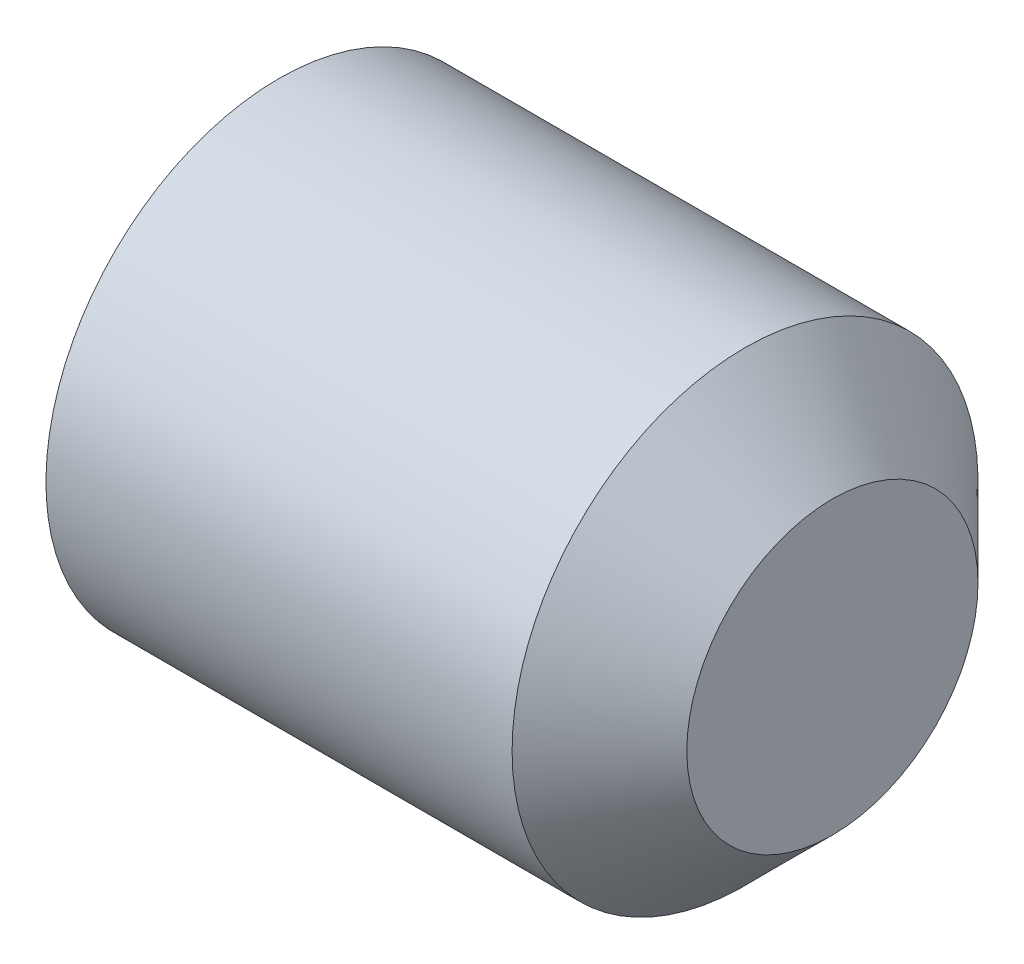
ISO-10303-21;
HEADER;
FILE_DESCRIPTION(('STEP AP214'),'2;1');
FILE_NAME('part.step','',(''),(''),'','','');
FILE_SCHEMA(('AUTOMOTIVE_DESIGN { 1 0 10303 214 1 1 1 1 }'));
ENDSEC;
DATA;
#1=APPLICATION_CONTEXT('core data for automotive mechanical design processes');
#2=APPLICATION_PROTOCOL_DEFINITION('international standard','automotive_design',2000,#1);
#3=PRODUCT_CONTEXT('',#1,'mechanical');
#4=PRODUCT('Part','Part','',(#3));
#5=PRODUCT_RELATED_PRODUCT_CATEGORY('part','',(#4));
#6=PRODUCT_DEFINITION_FORMATION('','',#4);
#7=PRODUCT_DEFINITION_CONTEXT('part definition',#1,'design');
#8=PRODUCT_DEFINITION('design','',#6,#7);
#9=PRODUCT_DEFINITION_SHAPE('','',#8);
#10=(LENGTH_UNIT() NAMED_UNIT(*) SI_UNIT(.MILLI.,.METRE.));
#11=(NAMED_UNIT(*) PLANE_ANGLE_UNIT() SI_UNIT($,.RADIAN.));
#12=(NAMED_UNIT(*) SI_UNIT($,.STERADIAN.) SOLID_ANGLE_UNIT());
#13=UNCERTAINTY_MEASURE_WITH_UNIT(LENGTH_MEASURE(1.E-05),#10,'distance_accuracy_value','');
#14=(GEOMETRIC_REPRESENTATION_CONTEXT(3) GLOBAL_UNCERTAINTY_ASSIGNED_CONTEXT((#13)) GLOBAL_UNIT_ASSIGNED_CONTEXT((#10,
#11,#12)) REPRESENTATION_CONTEXT('',''));
#15=CARTESIAN_POINT('',(0.,0.,0.));
#16=DIRECTION('',(0.,0.,1.));
#17=DIRECTION('',(1.,0.,0.));
#18=AXIS2_PLACEMENT_3D('',#15,#16,#17);
#19=CARTESIAN_POINT('',(1.5,0.,0.));
#20=DIRECTION('',(1.,0.,0.));
#21=DIRECTION('',(0.,0.,-1.));
#22=AXIS2_PLACEMENT_3D('',#19,#20,#21);
#23=PLANE('',#22);
#24=DIRECTION('',(0.,0.,-1.));
#25=VECTOR('',#24,1.);
#26=CARTESIAN_POINT('',(1.5,1.,-0.577350269189626));
#27=LINE('',#26,#25);
#28=CARTESIAN_POINT('',(1.5,1.,-0.577350269189625));
#29=VERTEX_POINT('',#28);
#30=CARTESIAN_POINT('',(1.5,1.,0.577350269189626));
#31=VERTEX_POINT('',#30);
#32=EDGE_CURVE('E91',#29,#31,#27,.F.);
#33=ORIENTED_EDGE('',*,*,#32,.F.);
#34=DIRECTION('',(0.,-0.866025403784439,-0.5));
#35=VECTOR('',#34,1.);
#36=CARTESIAN_POINT('',(1.5,0.,-1.15470053837925));
#37=LINE('',#36,#35);
#38=CARTESIAN_POINT('',(1.5,0.,-1.15470053837925));
#39=VERTEX_POINT('',#38);
#40=EDGE_CURVE('E255',#39,#29,#37,.F.);
#41=ORIENTED_EDGE('',*,*,#40,.F.);
#42=DIRECTION('',(0.,-0.866025403784439,0.5));
#43=VECTOR('',#42,1.);
#44=CARTESIAN_POINT('',(1.5,-1.,-0.577350269189626));
#45=LINE('',#44,#43);
#46=CARTESIAN_POINT('',(1.5,-1.,-0.577350269189626));
#47=VERTEX_POINT('',#46);
#48=EDGE_CURVE('E67',#47,#39,#45,.F.);
#49=ORIENTED_EDGE('',*,*,#48,.F.);
#50=DIRECTION('',(0.,0.,1.));
#51=VECTOR('',#50,1.);
#52=CARTESIAN_POINT('',(1.5,-1.,0.577350269189626));
#53=LINE('',#52,#51);
#54=CARTESIAN_POINT('',(1.5,-1.,0.577350269189626));
#55=VERTEX_POINT('',#54);
#56=EDGE_CURVE('E83',#55,#47,#53,.F.);
#57=ORIENTED_EDGE('',*,*,#56,.F.);
#58=DIRECTION('',(0.,0.866025403784439,0.5));
#59=VECTOR('',#58,1.);
#60=CARTESIAN_POINT('',(1.5,0.,1.15470053837925));
#61=LINE('',#60,#59);
#62=CARTESIAN_POINT('',(1.5,0.,1.15470053837925));
#63=VERTEX_POINT('',#62);
#64=EDGE_CURVE('E80',#63,#55,#61,.F.);
#65=ORIENTED_EDGE('',*,*,#64,.F.);
#66=DIRECTION('',(0.,0.866025403784439,-0.5));
#67=VECTOR('',#66,1.);
#68=CARTESIAN_POINT('',(1.5,1.,0.577350269189626));
#69=LINE('',#68,#67);
#70=EDGE_CURVE('E78',#31,#63,#69,.F.);
#71=ORIENTED_EDGE('',*,*,#70,.F.);
#72=EDGE_LOOP('',(#33,#41,#49,#57,#65,#71));
#73=FACE_BOUND('',#72,.T.);
#74=ADVANCED_FACE('F16',(#73),#23,.F.);
#75=CARTESIAN_POINT('',(1.5,0.,1.15470053837925));
#76=DIRECTION('',(0.,0.5,-0.866025403784439));
#77=DIRECTION('',(0.,0.866025403784439,0.5));
#78=AXIS2_PLACEMENT_3D('',#75,#76,#77);
#79=PLANE('',#78);
#80=ORIENTED_EDGE('',*,*,#64,.T.);
#81=DIRECTION('',(1.,0.,0.));
#82=VECTOR('',#81,1.);
#83=CARTESIAN_POINT('',(1.5,-1.,0.577350269189626));
#84=LINE('',#83,#82);
#85=CARTESIAN_POINT('',(-1.23908574132654E-11,-0.999999999981414,0.577350269178895));
#86=VERTEX_POINT('',#85);
#87=EDGE_CURVE('E58',#86,#55,#84,.T.);
#88=ORIENTED_EDGE('',*,*,#87,.F.);
#89=CARTESIAN_POINT('',(-2.17220619950333E-11,-0.999999999985159,0.577350269195539));
#90=CARTESIAN_POINT('',(0.0146522274131669,-0.956056056205261,0.602721316967818));
#91=CARTESIAN_POINT('',(0.0279776614242326,-0.911732788927363,0.628311367262774));
#92=CARTESIAN_POINT('',(0.0512368062699625,-0.822318826647086,0.679934542455114));
#93=CARTESIAN_POINT('',(0.061162289798958,-0.777226543448799,0.705968584297831));
#94=CARTESIAN_POINT('',(0.0766120204917856,-0.6876007831136,0.757714041153549));
#95=CARTESIAN_POINT('',(0.0822391061652361,-0.64308109218576,0.783417496695025));
#96=CARTESIAN_POINT('',(0.0889554158970128,-0.553832339764884,0.834945287930092));
#97=CARTESIAN_POINT('',(0.090050202974816,-0.50910360244421,0.860769436462681));
#98=CARTESIAN_POINT('',(0.0877668548847793,-0.425532755144338,0.909019087647659));
#99=CARTESIAN_POINT('',(0.0849493573545633,-0.386678104678669,0.931451830553285));
#100=CARTESIAN_POINT('',(0.0760213496053476,-0.309221929120891,0.97617117436197));
#101=CARTESIAN_POINT('',(0.0699077925813111,-0.270620671729051,0.998457620708205));
#102=CARTESIAN_POINT('',(0.0546250832995668,-0.193004929144995,1.04326909058246));
#103=CARTESIAN_POINT('',(0.0453911788614857,-0.15400026231692,1.0657884454753));
#104=CARTESIAN_POINT('',(0.0244341195552304,-0.0765725150088872,1.11049137622634));
#105=CARTESIAN_POINT('',(0.0127158856011599,-0.0381484433551789,1.13267552433897));
#106=CARTESIAN_POINT('',(-2.02274519031656E-11,-1.36600395062379E-11,1.15470053837136));
#107=B_SPLINE_CURVE_WITH_KNOTS('',3,(#89,#90,#91,#92,#93,#94,#95,#96,#97,#98,#99,#100,#101,#102,
#103,#104,#105,#106),.UNSPECIFIED.,.F.,.F.,(4,2,2,2,2,2,2,2,4),(0.,0.158508005773882,
0.317396908504243,0.472353803063711,0.627120444432828,0.761853891295061,0.896712096871438,
1.03456081121259,1.17213898671991),.UNSPECIFIED.);
#108=CARTESIAN_POINT('',(-1.01665114222455E-11,3.05008252019082E-11,1.15470053835394));
#109=VERTEX_POINT('',#108);
#110=EDGE_CURVE('E19',#86,#109,#107,.T.);
#111=ORIENTED_EDGE('',*,*,#110,.T.);
#112=DIRECTION('',(1.,0.,0.));
#113=VECTOR('',#112,1.);
#114=CARTESIAN_POINT('',(1.5,0.,1.15470053837925));
#115=LINE('',#114,#113);
#116=EDGE_CURVE('E86',#63,#109,#115,.F.);
#117=ORIENTED_EDGE('',*,*,#116,.F.);
#118=EDGE_LOOP('',(#80,#88,#111,#117));
#119=FACE_BOUND('',#118,.T.);
#120=ADVANCED_FACE('F87',(#119),#79,.T.);
#121=CARTESIAN_POINT('',(1.5,1.,0.577350269189626));
#122=DIRECTION('',(0.,-0.5,-0.866025403784439));
#123=DIRECTION('',(0.,0.866025403784439,-0.5));
#124=AXIS2_PLACEMENT_3D('',#121,#122,#123);
#125=PLANE('',#124);
#126=ORIENTED_EDGE('',*,*,#70,.T.);
#127=ORIENTED_EDGE('',*,*,#116,.T.);
#128=CARTESIAN_POINT('',(-2.17234236027891E-11,1.25417992105729E-11,1.15470053836935));
#129=CARTESIAN_POINT('',(0.0146522274131663,0.0439439437939134,1.12932949059963));
#130=CARTESIAN_POINT('',(0.0279776614242322,0.088267211072416,1.10373944030572));
#131=CARTESIAN_POINT('',(0.0512368062699621,0.177681173353136,1.05211626511415));
#132=CARTESIAN_POINT('',(0.0611622897989575,0.22277345655126,1.02608222327115));
#133=CARTESIAN_POINT('',(0.0766120204917849,0.312399216886343,0.974336766415227));
#134=CARTESIAN_POINT('',(0.0822391061652353,0.356918907814226,0.948633310873824));
#135=CARTESIAN_POINT('',(0.088955415897012,0.446167660235132,0.89710551963881));
#136=CARTESIAN_POINT('',(0.0900502029748152,0.490896397555795,0.871281371106201));
#137=CARTESIAN_POINT('',(0.0877668548847783,0.57446724485566,0.82303171992121));
#138=CARTESIAN_POINT('',(0.0849493573545621,0.613321895321331,0.800598977015589));
#139=CARTESIAN_POINT('',(0.0760213496053464,0.690778070879111,0.755879633206908));
#140=CARTESIAN_POINT('',(0.06990779258131,0.729379328270949,0.733593186860671));
#141=CARTESIAN_POINT('',(0.0546250832995658,0.806995070855005,0.688781716986413));
#142=CARTESIAN_POINT('',(0.0453911788614847,0.845999737683079,0.666262362093573));
#143=CARTESIAN_POINT('',(0.0244341195552295,0.923427484991112,0.621559431342534));
#144=CARTESIAN_POINT('',(0.012715885601159,0.961851556644821,0.599375283229904));
#145=CARTESIAN_POINT('',(-2.02282076327441E-11,0.999999999986339,0.577350269197513));
#146=B_SPLINE_CURVE_WITH_KNOTS('',3,(#128,#129,#130,#131,#132,#133,#134,#135,#136,#137,#138,
#139,#140,#141,#142,#143,#144,#145),.UNSPECIFIED.,.F.,.F.,(4,2,2,2,2,2,2,2,4),(0.,
0.158508005773882,0.317396908504244,0.472353803063713,0.627120444432829,0.761853891295061,
0.896712096871438,1.03456081121259,1.17213898671991),.UNSPECIFIED.);
#147=CARTESIAN_POINT('',(-1.01668733304713E-11,0.999999999993328,0.577350269150555));
#148=VERTEX_POINT('',#147);
#149=EDGE_CURVE('E187',#109,#148,#146,.T.);
#150=ORIENTED_EDGE('',*,*,#149,.T.);
#151=DIRECTION('',(1.,0.,0.));
#152=VECTOR('',#151,1.);
#153=CARTESIAN_POINT('',(1.5,1.,0.577350269189626));
#154=LINE('',#153,#152);
#155=EDGE_CURVE('E95',#31,#148,#154,.F.);
#156=ORIENTED_EDGE('',*,*,#155,.F.);
#157=EDGE_LOOP('',(#126,#127,#150,#156));
#158=FACE_BOUND('',#157,.T.);
#159=ADVANCED_FACE('F93',(#158),#125,.T.);
#160=CARTESIAN_POINT('',(1.5,1.,-0.577350269189626));
#161=DIRECTION('',(0.,-1.,0.));
#162=DIRECTION('',(0.,0.,-1.));
#163=AXIS2_PLACEMENT_3D('',#160,#161,#162);
#164=PLANE('',#163);
#165=ORIENTED_EDGE('',*,*,#32,.T.);
#166=ORIENTED_EDGE('',*,*,#155,.T.);
#167=CARTESIAN_POINT('',(-2.17234032401271E-11,0.999999999997701,0.577350269173817));
#168=CARTESIAN_POINT('',(0.014652227416164,0.999999999999174,0.526608173630969));
#169=CARTESIAN_POINT('',(0.0279776614299832,0.999999999999779,0.475428073041089));
#170=CARTESIAN_POINT('',(0.051236806280488,1.00000000000022,0.372181722654782));
#171=CARTESIAN_POINT('',(0.0611622898114993,1.00000000000006,0.320113638967684));
#172=CARTESIAN_POINT('',(0.0766120205072203,0.999999999999943,0.216622725253549));
#173=CARTESIAN_POINT('',(0.0822391061816121,0.999999999999985,0.165215814169564));
#174=CARTESIAN_POINT('',(0.088955415914194,1.00000000000002,0.0621602316972014));
#175=CARTESIAN_POINT('',(0.0900502029918649,1.,0.010511934630825));
#176=CARTESIAN_POINT('',(0.0877668549006299,0.999999999999997,-0.0859873677392219));
#177=CARTESIAN_POINT('',(0.0849493573696367,0.999999999999999,-0.130852853549384));
#178=CARTESIAN_POINT('',(0.0760213496184482,1.,-0.220291541164473));
#179=CARTESIAN_POINT('',(0.0699077925932146,1.,-0.264864433855753));
#180=CARTESIAN_POINT('',(0.0546250833086639,1.,-0.354487373602032));
#181=CARTESIAN_POINT('',(0.0453911788689434,1.,-0.399526083386662));
#182=CARTESIAN_POINT('',(0.0244341195591375,1.,-0.488931944886426));
#183=CARTESIAN_POINT('',(0.0127158856031582,1.,-0.533300241110423));
#184=CARTESIAN_POINT('',(-2.02280432261512E-11,1.,-0.577350269173851));
#185=B_SPLINE_CURVE_WITH_KNOTS('',3,(#167,#168,#169,#170,#171,#172,#173,#174,#175,#176,#177,
#178,#179,#180,#181,#182,#183,#184),.UNSPECIFIED.,.F.,.F.,(4,2,2,2,2,2,2,2,4),(0.,
0.15850800577884,0.317396908514346,0.472353803077335,0.627120444449877,0.761853891308974,
0.896712096882263,1.03456081122129,1.17213898672639),.UNSPECIFIED.);
#186=CARTESIAN_POINT('',(-1.01669210418351E-11,0.999999999962828,-0.577350269203382));
#187=VERTEX_POINT('',#186);
#188=EDGE_CURVE('E168',#148,#187,#185,.T.);
#189=ORIENTED_EDGE('',*,*,#188,.T.);
#190=DIRECTION('',(1.,0.,0.));
#191=VECTOR('',#190,1.);
#192=CARTESIAN_POINT('',(1.5,1.,-0.577350269189625));
#193=LINE('',#192,#191);
#194=EDGE_CURVE('E252',#29,#187,#193,.F.);
#195=ORIENTED_EDGE('',*,*,#194,.F.);
#196=EDGE_LOOP('',(#165,#166,#189,#195));
#197=FACE_BOUND('',#196,.T.);
#198=ADVANCED_FACE('F158',(#197),#164,.T.);
#199=CARTESIAN_POINT('',(1.5,0.,-1.15470053837925));
#200=DIRECTION('',(0.,-0.5,0.866025403784439));
#201=DIRECTION('',(0.,-0.866025403784439,-0.5));
#202=AXIS2_PLACEMENT_3D('',#199,#200,#201);
#203=PLANE('',#202);
#204=ORIENTED_EDGE('',*,*,#40,.T.);
#205=ORIENTED_EDGE('',*,*,#194,.T.);
#206=CARTESIAN_POINT('',(-2.17223735830667E-11,0.999999999985159,-0.577350269195538));
#207=CARTESIAN_POINT('',(0.0146522274131669,0.956056056205261,-0.602721316967817));
#208=CARTESIAN_POINT('',(0.0279776614242326,0.911732788927363,-0.628311367262774));
#209=CARTESIAN_POINT('',(0.0512368062699624,0.822318826647086,-0.679934542455114));
#210=CARTESIAN_POINT('',(0.0611622897989579,0.777226543448799,-0.705968584297831));
#211=CARTESIAN_POINT('',(0.0766120204917855,0.6876007831136,-0.757714041153549));
#212=CARTESIAN_POINT('',(0.082239106165236,0.64308109218576,-0.783417496695025));
#213=CARTESIAN_POINT('',(0.0889554158970128,0.553832339764884,-0.834945287930092));
#214=CARTESIAN_POINT('',(0.090050202974816,0.50910360244421,-0.860769436462681));
#215=CARTESIAN_POINT('',(0.0877668548847792,0.425532755144338,-0.90901908764766));
#216=CARTESIAN_POINT('',(0.0849493573545632,0.386678104678669,-0.931451830553285));
#217=CARTESIAN_POINT('',(0.0760213496053475,0.30922192912089,-0.97617117436197));
#218=CARTESIAN_POINT('',(0.069907792581311,0.270620671729051,-0.998457620708205));
#219=CARTESIAN_POINT('',(0.0546250832995667,0.193004929144995,-1.04326909058246));
#220=CARTESIAN_POINT('',(0.0453911788614856,0.15400026231692,-1.0657884454753));
#221=CARTESIAN_POINT('',(0.0244341195552303,0.076572515008887,-1.11049137622634));
#222=CARTESIAN_POINT('',(0.0127158856011598,0.0381484433551788,-1.13267552433897));
#223=CARTESIAN_POINT('',(-2.02274713971243E-11,1.36599810241033E-11,-1.15470053837136));
#224=B_SPLINE_CURVE_WITH_KNOTS('',3,(#206,#207,#208,#209,#210,#211,#212,#213,#214,#215,#216,
#217,#218,#219,#220,#221,#222,#223),.UNSPECIFIED.,.F.,.F.,(4,2,2,2,2,2,2,2,4),(0.,
0.158508005773882,0.317396908504243,0.472353803063711,0.627120444432828,0.761853891295061,
0.896712096871438,1.03456081121259,1.17213898671991),.UNSPECIFIED.);
#225=CARTESIAN_POINT('',(-1.01665178539241E-11,-3.05008444969441E-11,-1.15470053835394));
#226=VERTEX_POINT('',#225);
#227=EDGE_CURVE('E162',#187,#226,#224,.T.);
#228=ORIENTED_EDGE('',*,*,#227,.T.);
#229=DIRECTION('',(1.,0.,0.));
#230=VECTOR('',#229,1.);
#231=CARTESIAN_POINT('',(1.5,0.,-1.15470053837925));
#232=LINE('',#231,#230);
#233=EDGE_CURVE('E246',#39,#226,#232,.F.);
#234=ORIENTED_EDGE('',*,*,#233,.F.);
#235=EDGE_LOOP('',(#204,#205,#228,#234));
#236=FACE_BOUND('',#235,.T.);
#237=ADVANCED_FACE('F154',(#236),#203,.T.);
#238=CARTESIAN_POINT('',(1.5,-1.,-0.577350269189626));
#239=DIRECTION('',(0.,0.5,0.866025403784439));
#240=DIRECTION('',(0.,-0.866025403784439,0.5));
#241=AXIS2_PLACEMENT_3D('',#238,#239,#240);
#242=PLANE('',#241);
#243=ORIENTED_EDGE('',*,*,#48,.T.);
#244=ORIENTED_EDGE('',*,*,#233,.T.);
#245=CARTESIAN_POINT('',(-2.17234283129561E-11,-1.25418450033032E-11,-1.15470053836935));
#246=CARTESIAN_POINT('',(0.0146522274131663,-0.0439439437939133,-1.12932949059963));
#247=CARTESIAN_POINT('',(0.0279776614242322,-0.088267211072416,-1.10373944030572));
#248=CARTESIAN_POINT('',(0.0512368062699621,-0.177681173353136,-1.05211626511415));
#249=CARTESIAN_POINT('',(0.0611622897989575,-0.22277345655126,-1.02608222327115));
#250=CARTESIAN_POINT('',(0.0766120204917849,-0.312399216886343,-0.974336766415227));
#251=CARTESIAN_POINT('',(0.0822391061652354,-0.356918907814226,-0.948633310873824));
#252=CARTESIAN_POINT('',(0.0889554158970121,-0.446167660235132,-0.89710551963881));
#253=CARTESIAN_POINT('',(0.0900502029748152,-0.490896397555795,-0.871281371106201));
#254=CARTESIAN_POINT('',(0.0877668548847784,-0.57446724485566,-0.82303171992121));
#255=CARTESIAN_POINT('',(0.0849493573545623,-0.613321895321331,-0.800598977015589));
#256=CARTESIAN_POINT('',(0.0760213496053465,-0.690778070879111,-0.755879633206908));
#257=CARTESIAN_POINT('',(0.0699077925813101,-0.729379328270949,-0.733593186860671));
#258=CARTESIAN_POINT('',(0.0546250832995658,-0.806995070855005,-0.688781716986413));
#259=CARTESIAN_POINT('',(0.0453911788614846,-0.84599973768308,-0.666262362093573));
#260=CARTESIAN_POINT('',(0.0244341195552294,-0.923427484991113,-0.621559431342534));
#261=CARTESIAN_POINT('',(0.0127158856011589,-0.961851556644821,-0.599375283229904));
#262=CARTESIAN_POINT('',(-2.02281965601044E-11,-0.999999999986339,-0.577350269197513));
#263=B_SPLINE_CURVE_WITH_KNOTS('',3,(#245,#246,#247,#248,#249,#250,#251,#252,#253,#254,#255,
#256,#257,#258,#259,#260,#261,#262),.UNSPECIFIED.,.F.,.F.,(4,2,2,2,2,2,2,2,4),(0.,
0.158508005773882,0.317396908504244,0.472353803063713,0.627120444432829,0.761853891295062,
0.896712096871439,1.03456081121259,1.17213898671991),.UNSPECIFIED.);
#264=CARTESIAN_POINT('',(-1.01668893825575E-11,-0.999999999993328,-0.577350269150555));
#265=VERTEX_POINT('',#264);
#266=EDGE_CURVE('E38',#226,#265,#263,.T.);
#267=ORIENTED_EDGE('',*,*,#266,.T.);
#268=DIRECTION('',(1.,0.,0.));
#269=VECTOR('',#268,1.);
#270=CARTESIAN_POINT('',(1.5,-1.,-0.577350269189626));
#271=LINE('',#270,#269);
#272=EDGE_CURVE('E234',#47,#265,#271,.F.);
#273=ORIENTED_EDGE('',*,*,#272,.F.);
#274=EDGE_LOOP('',(#243,#244,#267,#273));
#275=FACE_BOUND('',#274,.T.);
#276=ADVANCED_FACE('F147',(#275),#242,.T.);
#277=CARTESIAN_POINT('',(1.5,-1.,0.577350269189626));
#278=DIRECTION('',(0.,1.,0.));
#279=DIRECTION('',(0.,0.,1.));
#280=AXIS2_PLACEMENT_3D('',#277,#278,#279);
#281=PLANE('',#280);
#282=ORIENTED_EDGE('',*,*,#56,.T.);
#283=ORIENTED_EDGE('',*,*,#272,.T.);
#284=CARTESIAN_POINT('',(-2.17231431270612E-11,-0.999999999997701,-0.577350269173817));
#285=CARTESIAN_POINT('',(0.0146522274176678,-0.999999999999174,-0.526608173630546));
#286=CARTESIAN_POINT('',(0.027977661432868,-0.999999999999779,-0.475428073040158));
#287=CARTESIAN_POINT('',(0.0512368062857677,-1.00000000000022,-0.372181722652651));
#288=CARTESIAN_POINT('',(0.0611622898177901,-1.00000000000006,-0.320113638964861));
#289=CARTESIAN_POINT('',(0.0766120205149624,-0.999999999999943,-0.216622725249472));
#290=CARTESIAN_POINT('',(0.0822391061898264,-0.999999999999985,-0.165215814164933));
#291=CARTESIAN_POINT('',(0.0889554159228121,-1.00000000000002,-0.0621602316914254));
#292=CARTESIAN_POINT('',(0.0900502030004166,-1.,-0.0105119346244585));
#293=CARTESIAN_POINT('',(0.0877668549085807,-0.999999999999997,0.0859873677456275));
#294=CARTESIAN_POINT('',(0.0849493573771976,-0.999999999999999,0.130852853555246));
#295=CARTESIAN_POINT('',(0.0760213496250198,-1.,0.220291541169193));
#296=CARTESIAN_POINT('',(0.0699077925991858,-1.,0.264864433859874));
#297=CARTESIAN_POINT('',(0.0546250833132274,-1.,0.354487373605032));
#298=CARTESIAN_POINT('',(0.0453911788726847,-1.,0.399526083389136));
#299=CARTESIAN_POINT('',(0.0244341195610978,-1.,0.488931944887739));
#300=CARTESIAN_POINT('',(0.012715885604161,-1.,0.533300241111102));
#301=CARTESIAN_POINT('',(-2.0228041820151E-11,-1.,0.577350269173852));
#302=B_SPLINE_CURVE_WITH_KNOTS('',3,(#284,#285,#286,#287,#288,#289,#290,#291,#292,#293,#294,
#295,#296,#297,#298,#299,#300,#301),.UNSPECIFIED.,.F.,.F.,(4,2,2,2,2,2,2,2,4),(0.,
0.158508005781326,0.317396908519412,0.472353803084168,0.627120444458428,0.761853891315952,
0.896712096887692,1.03456081122566,1.17213898672964),.UNSPECIFIED.);
#303=EDGE_CURVE('E127',#265,#86,#302,.T.);
#304=ORIENTED_EDGE('',*,*,#303,.T.);
#305=ORIENTED_EDGE('',*,*,#87,.T.);
#306=EDGE_LOOP('',(#282,#283,#304,#305));
#307=FACE_BOUND('',#306,.T.);
#308=ADVANCED_FACE('F143',(#307),#281,.T.);
#309=CARTESIAN_POINT('',(0.,0.,0.));
#310=DIRECTION('',(-1.,0.,0.));
#311=DIRECTION('',(0.,-1.,0.));
#312=AXIS2_PLACEMENT_3D('',#309,#310,#311);
#313=CONICAL_SURFACE('',#312,1.15470053833633,1.04719755126055);
#314=CARTESIAN_POINT('',(0.,0.,0.));
#315=DIRECTION('',(-1.,0.,0.));
#316=DIRECTION('',(0.,-1.,0.));
#317=AXIS2_PLACEMENT_3D('',#314,#315,#316);
#318=CIRCLE('',#317,1.15470053833633);
#319=EDGE_CURVE('E125',#86,#109,#318,.T.);
#320=ORIENTED_EDGE('',*,*,#319,.T.);
#321=ORIENTED_EDGE('',*,*,#110,.F.);
#322=EDGE_LOOP('',(#320,#321));
#323=FACE_BOUND('',#322,.T.);
#324=ADVANCED_FACE('F146',(#323),#313,.F.);
#325=CARTESIAN_POINT('',(0.,0.,0.));
#326=DIRECTION('',(-1.,0.,0.));
#327=DIRECTION('',(0.,-1.,0.));
#328=AXIS2_PLACEMENT_3D('',#325,#326,#327);
#329=CONICAL_SURFACE('',#328,1.15470053833633,1.04719755126055);
#330=CARTESIAN_POINT('',(0.,0.,0.));
#331=DIRECTION('',(-1.,0.,0.));
#332=DIRECTION('',(0.,-1.,0.));
#333=AXIS2_PLACEMENT_3D('',#330,#331,#332);
#334=CIRCLE('',#333,1.15470053833633);
#335=EDGE_CURVE('E122',#109,#148,#334,.T.);
#336=ORIENTED_EDGE('',*,*,#335,.T.);
#337=ORIENTED_EDGE('',*,*,#149,.F.);
#338=EDGE_LOOP('',(#336,#337));
#339=FACE_BOUND('',#338,.T.);
#340=ADVANCED_FACE('F182',(#339),#329,.F.);
#341=CARTESIAN_POINT('',(0.,0.,0.));
#342=DIRECTION('',(-1.,0.,0.));
#343=DIRECTION('',(0.,-1.,0.));
#344=AXIS2_PLACEMENT_3D('',#341,#342,#343);
#345=CONICAL_SURFACE('',#344,1.15470053833633,1.04719755117909);
#346=CARTESIAN_POINT('',(0.,0.,0.));
#347=DIRECTION('',(-1.,0.,0.));
#348=DIRECTION('',(0.,-1.,0.));
#349=AXIS2_PLACEMENT_3D('',#346,#347,#348);
#350=CIRCLE('',#349,1.15470053833633);
#351=EDGE_CURVE('E119',#148,#187,#350,.T.);
#352=ORIENTED_EDGE('',*,*,#351,.T.);
#353=ORIENTED_EDGE('',*,*,#188,.F.);
#354=EDGE_LOOP('',(#352,#353));
#355=FACE_BOUND('',#354,.T.);
#356=ADVANCED_FACE('F177',(#355),#345,.F.);
#357=CARTESIAN_POINT('',(0.,0.,0.));
#358=DIRECTION('',(-1.,0.,0.));
#359=DIRECTION('',(0.,-1.,0.));
#360=AXIS2_PLACEMENT_3D('',#357,#358,#359);
#361=CONICAL_SURFACE('',#360,1.15470053833633,1.04719755126055);
#362=CARTESIAN_POINT('',(0.,0.,0.));
#363=DIRECTION('',(-1.,0.,0.));
#364=DIRECTION('',(0.,-1.,0.));
#365=AXIS2_PLACEMENT_3D('',#362,#363,#364);
#366=CIRCLE('',#365,1.15470053833633);
#367=EDGE_CURVE('E116',#187,#226,#366,.T.);
#368=ORIENTED_EDGE('',*,*,#367,.T.);
#369=ORIENTED_EDGE('',*,*,#227,.F.);
#370=EDGE_LOOP('',(#368,#369));
#371=FACE_BOUND('',#370,.T.);
#372=ADVANCED_FACE('F173',(#371),#361,.F.);
#373=CARTESIAN_POINT('',(0.,0.,0.));
#374=DIRECTION('',(-1.,0.,0.));
#375=DIRECTION('',(0.,-1.,0.));
#376=AXIS2_PLACEMENT_3D('',#373,#374,#375);
#377=CONICAL_SURFACE('',#376,1.15470053833633,1.04719755126055);
#378=CARTESIAN_POINT('',(0.,0.,0.));
#379=DIRECTION('',(-1.,0.,0.));
#380=DIRECTION('',(0.,-1.,0.));
#381=AXIS2_PLACEMENT_3D('',#378,#379,#380);
#382=CIRCLE('',#381,1.15470053833633);
#383=EDGE_CURVE('E113',#226,#265,#382,.T.);
#384=ORIENTED_EDGE('',*,*,#383,.T.);
#385=ORIENTED_EDGE('',*,*,#266,.F.);
#386=EDGE_LOOP('',(#384,#385));
#387=FACE_BOUND('',#386,.T.);
#388=ADVANCED_FACE('F176',(#387),#377,.F.);
#389=CARTESIAN_POINT('',(0.,0.,0.));
#390=DIRECTION('',(-1.,0.,0.));
#391=DIRECTION('',(0.,-1.,0.));
#392=AXIS2_PLACEMENT_3D('',#389,#390,#391);
#393=CONICAL_SURFACE('',#392,1.15470053833633,1.04719755113824);
#394=CARTESIAN_POINT('',(0.,0.,0.));
#395=DIRECTION('',(-1.,0.,0.));
#396=DIRECTION('',(0.,-1.,0.));
#397=AXIS2_PLACEMENT_3D('',#394,#395,#396);
#398=CIRCLE('',#397,1.15470053833633);
#399=EDGE_CURVE('E110',#265,#86,#398,.T.);
#400=ORIENTED_EDGE('',*,*,#399,.T.);
#401=ORIENTED_EDGE('',*,*,#303,.F.);
#402=EDGE_LOOP('',(#400,#401));
#403=FACE_BOUND('',#402,.T.);
#404=ADVANCED_FACE('F140',(#403),#393,.F.);
#405=CARTESIAN_POINT('',(0.,-1.5705,0.));
#406=DIRECTION('',(1.,0.,0.));
#407=DIRECTION('',(0.,1.,0.));
#408=AXIS2_PLACEMENT_3D('',#405,#406,#407);
#409=PLANE('',#408);
#410=CARTESIAN_POINT('',(8.79374698059543E-12,0.,0.));
#411=DIRECTION('',(1.,0.,0.));
#412=DIRECTION('',(0.,1.,0.));
#413=AXIS2_PLACEMENT_3D('',#410,#411,#412);
#414=CIRCLE('',#413,1.57050000001391);
#415=CARTESIAN_POINT('',(8.79364055937593E-12,1.57050000001391,0.));
#416=VERTEX_POINT('',#415);
#417=EDGE_CURVE('E107',#416,#416,#414,.T.);
#418=ORIENTED_EDGE('',*,*,#417,.F.);
#419=EDGE_LOOP('',(#418));
#420=FACE_BOUND('',#419,.T.);
#421=ORIENTED_EDGE('',*,*,#383,.F.);
#422=ORIENTED_EDGE('',*,*,#367,.F.);
#423=ORIENTED_EDGE('',*,*,#351,.F.);
#424=ORIENTED_EDGE('',*,*,#335,.F.);
#425=ORIENTED_EDGE('',*,*,#319,.F.);
#426=ORIENTED_EDGE('',*,*,#399,.F.);
#427=EDGE_LOOP('',(#421,#422,#423,#424,#425,#426));
#428=FACE_BOUND('',#427,.T.);
#429=ADVANCED_FACE('F217',(#420,#428),#409,.F.);
#430=CARTESIAN_POINT('',(5.,0.,0.));
#431=DIRECTION('',(-1.,0.,0.));
#432=DIRECTION('',(0.,-1.,0.));
#433=AXIS2_PLACEMENT_3D('',#430,#431,#432);
#434=PLANE('',#433);
#435=CARTESIAN_POINT('',(4.99999999999545,0.,0.));
#436=DIRECTION('',(-1.,0.,0.));
#437=DIRECTION('',(0.,0.,1.));
#438=AXIS2_PLACEMENT_3D('',#435,#436,#437);
#439=CIRCLE('',#438,1.25000000002729);
#440=CARTESIAN_POINT('',(4.99999999999545,0.,1.25000000002729));
#441=VERTEX_POINT('',#440);
#442=EDGE_CURVE('E104',#441,#441,#439,.T.);
#443=ORIENTED_EDGE('',*,*,#442,.F.);
#444=EDGE_LOOP('',(#443));
#445=FACE_BOUND('',#444,.T.);
#446=ADVANCED_FACE('F214',(#445),#434,.F.);
#447=CARTESIAN_POINT('',(0.247971940552816,0.,0.));
#448=DIRECTION('',(1.,0.,0.));
#449=DIRECTION('',(0.,1.,0.));
#450=AXIS2_PLACEMENT_3D('',#447,#448,#449);
#451=CONICAL_SURFACE('',#450,1.99999999989586,1.04719755120492);
#452=CARTESIAN_POINT('',(0.247971940616944,0.,0.));
#453=DIRECTION('',(1.,0.,0.));
#454=DIRECTION('',(0.,1.,0.));
#455=AXIS2_PLACEMENT_3D('',#452,#453,#454);
#456=CIRCLE('',#455,2.);
#457=CARTESIAN_POINT('',(0.247971940616944,2.,0.));
#458=VERTEX_POINT('',#457);
#459=EDGE_CURVE('E29',#458,#458,#456,.T.);
#460=ORIENTED_EDGE('',*,*,#459,.F.);
#461=EDGE_LOOP('',(#460));
#462=FACE_BOUND('',#461,.T.);
#463=ORIENTED_EDGE('',*,*,#417,.T.);
#464=EDGE_LOOP('',(#463));
#465=FACE_BOUND('',#464,.T.);
#466=ADVANCED_FACE('F207',(#462,#465),#451,.T.);
#467=CARTESIAN_POINT('',(4.25000000001319,0.,0.));
#468=DIRECTION('',(-1.,0.,0.));
#469=DIRECTION('',(0.,0.,1.));
#470=AXIS2_PLACEMENT_3D('',#467,#468,#469);
#471=CONICAL_SURFACE('',#470,2.00000000006639,0.785398163435344);
#472=ORIENTED_EDGE('',*,*,#442,.T.);
#473=EDGE_LOOP('',(#472));
#474=FACE_BOUND('',#473,.T.);
#475=CARTESIAN_POINT('',(4.25,0.,0.));
#476=DIRECTION('',(1.,0.,0.));
#477=DIRECTION('',(0.,1.,0.));
#478=AXIS2_PLACEMENT_3D('',#475,#476,#477);
#479=CIRCLE('',#478,2.);
#480=CARTESIAN_POINT('',(4.25,2.,0.));
#481=VERTEX_POINT('',#480);
#482=EDGE_CURVE('E11',#481,#481,#479,.F.);
#483=ORIENTED_EDGE('',*,*,#482,.F.);
#484=EDGE_LOOP('',(#483));
#485=FACE_BOUND('',#484,.T.);
#486=ADVANCED_FACE('F201',(#474,#485),#471,.T.);
#487=CARTESIAN_POINT('',(0.666666666666667,0.,0.));
#488=DIRECTION('',(1.,0.,0.));
#489=DIRECTION('',(0.,1.,0.));
#490=AXIS2_PLACEMENT_3D('',#487,#488,#489);
#491=CYLINDRICAL_SURFACE('',#490,2.);
#492=ORIENTED_EDGE('',*,*,#482,.T.);
#493=EDGE_LOOP('',(#492));
#494=FACE_BOUND('',#493,.T.);
#495=ORIENTED_EDGE('',*,*,#459,.T.);
#496=EDGE_LOOP('',(#495));
#497=FACE_BOUND('',#496,.T.);
#498=ADVANCED_FACE('F199',(#494,#497),#491,.T.);
#499=CLOSED_SHELL('',(#74,#120,#159,#198,#237,#276,#308,#324,#340,#356,#372,#388,#404,#429,#446,
#466,#486,#498));
#500=MANIFOLD_SOLID_BREP('B1',#499);
#501=ADVANCED_BREP_SHAPE_REPRESENTATION('',(#18,#500),#14);
#502=SHAPE_DEFINITION_REPRESENTATION(#9,#501);
ENDSEC;
END-ISO-10303-21;
